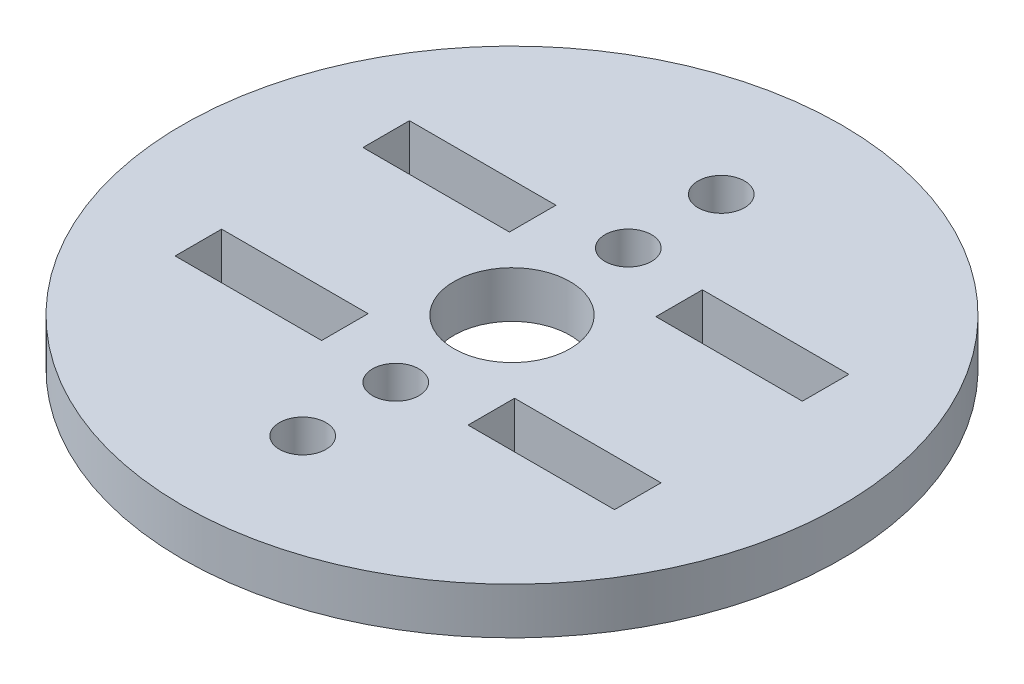
ISO-10303-21;
HEADER;
FILE_DESCRIPTION(('STEP AP214'),'2;1');
FILE_NAME('part.step','',(''),(''),'','','');
FILE_SCHEMA(('AUTOMOTIVE_DESIGN { 1 0 10303 214 1 1 1 1 }'));
ENDSEC;
DATA;
#1=APPLICATION_CONTEXT('core data for automotive mechanical design processes');
#2=APPLICATION_PROTOCOL_DEFINITION('international standard','automotive_design',2000,#1);
#3=PRODUCT_CONTEXT('',#1,'mechanical');
#4=PRODUCT('Part','Part','',(#3));
#5=PRODUCT_RELATED_PRODUCT_CATEGORY('part','',(#4));
#6=PRODUCT_DEFINITION_FORMATION('','',#4);
#7=PRODUCT_DEFINITION_CONTEXT('part definition',#1,'design');
#8=PRODUCT_DEFINITION('design','',#6,#7);
#9=PRODUCT_DEFINITION_SHAPE('','',#8);
#10=(LENGTH_UNIT() NAMED_UNIT(*) SI_UNIT(.MILLI.,.METRE.));
#11=(NAMED_UNIT(*) PLANE_ANGLE_UNIT() SI_UNIT($,.RADIAN.));
#12=(NAMED_UNIT(*) SI_UNIT($,.STERADIAN.) SOLID_ANGLE_UNIT());
#13=UNCERTAINTY_MEASURE_WITH_UNIT(LENGTH_MEASURE(1.E-05),#10,'distance_accuracy_value','');
#14=(GEOMETRIC_REPRESENTATION_CONTEXT(3) GLOBAL_UNCERTAINTY_ASSIGNED_CONTEXT((#13)) GLOBAL_UNIT_ASSIGNED_CONTEXT((#10,
#11,#12)) REPRESENTATION_CONTEXT('',''));
#15=CARTESIAN_POINT('',(0.,0.,0.));
#16=DIRECTION('',(0.,0.,1.));
#17=DIRECTION('',(1.,0.,0.));
#18=AXIS2_PLACEMENT_3D('',#15,#16,#17);
#19=CARTESIAN_POINT('',(0.,3.175,0.));
#20=DIRECTION('',(0.,1.,0.));
#21=DIRECTION('',(0.,0.,1.));
#22=AXIS2_PLACEMENT_3D('',#19,#20,#21);
#23=PLANE('',#22);
#24=CARTESIAN_POINT('',(0.,3.175,-14.2875));
#25=DIRECTION('',(0.,1.,0.));
#26=DIRECTION('',(0.,0.,1.));
#27=AXIS2_PLACEMENT_3D('',#24,#25,#26);
#28=CIRCLE('',#27,1.5875);
#29=CARTESIAN_POINT('',(0.,3.175,-12.7));
#30=VERTEX_POINT('',#29);
#31=EDGE_CURVE('E312',#30,#30,#28,.T.);
#32=ORIENTED_EDGE('',*,*,#31,.F.);
#33=EDGE_LOOP('',(#32));
#34=FACE_BOUND('',#33,.T.);
#35=CARTESIAN_POINT('',(0.,3.175,-7.9375));
#36=DIRECTION('',(0.,1.,0.));
#37=DIRECTION('',(0.,0.,1.));
#38=AXIS2_PLACEMENT_3D('',#35,#36,#37);
#39=CIRCLE('',#38,1.5875);
#40=CARTESIAN_POINT('',(0.,3.175,-6.35));
#41=VERTEX_POINT('',#40);
#42=EDGE_CURVE('E177',#41,#41,#39,.T.);
#43=ORIENTED_EDGE('',*,*,#42,.F.);
#44=EDGE_LOOP('',(#43));
#45=FACE_BOUND('',#44,.T.);
#46=DIRECTION('',(1.,0.,0.));
#47=VECTOR('',#46,1.);
#48=CARTESIAN_POINT('',(-15.,3.175,8.));
#49=LINE('',#48,#47);
#50=CARTESIAN_POINT('',(-15.,3.175,8.));
#51=VERTEX_POINT('',#50);
#52=CARTESIAN_POINT('',(-5.,3.175,8.));
#53=VERTEX_POINT('',#52);
#54=EDGE_CURVE('E189',#51,#53,#49,.T.);
#55=ORIENTED_EDGE('',*,*,#54,.F.);
#56=DIRECTION('',(0.,0.,1.));
#57=VECTOR('',#56,1.);
#58=CARTESIAN_POINT('',(-15.,3.175,4.825));
#59=LINE('',#58,#57);
#60=CARTESIAN_POINT('',(-15.,3.175,4.825));
#61=VERTEX_POINT('',#60);
#62=EDGE_CURVE('E187',#61,#51,#59,.T.);
#63=ORIENTED_EDGE('',*,*,#62,.F.);
#64=DIRECTION('',(-1.,0.,0.));
#65=VECTOR('',#64,1.);
#66=CARTESIAN_POINT('',(-15.,3.175,4.825));
#67=LINE('',#66,#65);
#68=CARTESIAN_POINT('',(-5.,3.175,4.825));
#69=VERTEX_POINT('',#68);
#70=EDGE_CURVE('E195',#69,#61,#67,.T.);
#71=ORIENTED_EDGE('',*,*,#70,.F.);
#72=DIRECTION('',(0.,0.,-1.));
#73=VECTOR('',#72,1.);
#74=CARTESIAN_POINT('',(-5.,3.175,4.825));
#75=LINE('',#74,#73);
#76=EDGE_CURVE('E192',#53,#69,#75,.T.);
#77=ORIENTED_EDGE('',*,*,#76,.F.);
#78=EDGE_LOOP('',(#55,#63,#71,#77));
#79=FACE_BOUND('',#78,.T.);
#80=DIRECTION('',(1.,0.,0.));
#81=VECTOR('',#80,1.);
#82=CARTESIAN_POINT('',(-15.,3.175,-4.825));
#83=LINE('',#82,#81);
#84=CARTESIAN_POINT('',(-15.,3.175,-4.825));
#85=VERTEX_POINT('',#84);
#86=CARTESIAN_POINT('',(-5.,3.175,-4.825));
#87=VERTEX_POINT('',#86);
#88=EDGE_CURVE('E251',#85,#87,#83,.T.);
#89=ORIENTED_EDGE('',*,*,#88,.F.);
#90=DIRECTION('',(0.,0.,1.));
#91=VECTOR('',#90,1.);
#92=CARTESIAN_POINT('',(-15.,3.175,-8.));
#93=LINE('',#92,#91);
#94=CARTESIAN_POINT('',(-15.,3.175,-8.));
#95=VERTEX_POINT('',#94);
#96=EDGE_CURVE('E249',#95,#85,#93,.T.);
#97=ORIENTED_EDGE('',*,*,#96,.F.);
#98=DIRECTION('',(-1.,0.,0.));
#99=VECTOR('',#98,1.);
#100=CARTESIAN_POINT('',(-15.,3.175,-8.));
#101=LINE('',#100,#99);
#102=CARTESIAN_POINT('',(-5.,3.175,-8.));
#103=VERTEX_POINT('',#102);
#104=EDGE_CURVE('E257',#103,#95,#101,.T.);
#105=ORIENTED_EDGE('',*,*,#104,.F.);
#106=DIRECTION('',(0.,0.,-1.));
#107=VECTOR('',#106,1.);
#108=CARTESIAN_POINT('',(-5.,3.175,-8.));
#109=LINE('',#108,#107);
#110=EDGE_CURVE('E254',#87,#103,#109,.T.);
#111=ORIENTED_EDGE('',*,*,#110,.F.);
#112=EDGE_LOOP('',(#89,#97,#105,#111));
#113=FACE_BOUND('',#112,.T.);
#114=CARTESIAN_POINT('',(0.,3.175,0.));
#115=DIRECTION('',(0.,1.,0.));
#116=DIRECTION('',(0.,0.,1.));
#117=AXIS2_PLACEMENT_3D('',#114,#115,#116);
#118=CIRCLE('',#117,22.5);
#119=CARTESIAN_POINT('',(0.,3.175,22.5));
#120=VERTEX_POINT('',#119);
#121=EDGE_CURVE('E11',#120,#120,#118,.T.);
#122=ORIENTED_EDGE('',*,*,#121,.T.);
#123=EDGE_LOOP('',(#122));
#124=FACE_BOUND('',#123,.T.);
#125=CARTESIAN_POINT('',(0.,3.175,0.));
#126=DIRECTION('',(0.,1.,0.));
#127=DIRECTION('',(0.,0.,1.));
#128=AXIS2_PLACEMENT_3D('',#125,#126,#127);
#129=CIRCLE('',#128,3.96875);
#130=CARTESIAN_POINT('',(0.,3.175,3.96875));
#131=VERTEX_POINT('',#130);
#132=EDGE_CURVE('E280',#131,#131,#129,.T.);
#133=ORIENTED_EDGE('',*,*,#132,.F.);
#134=EDGE_LOOP('',(#133));
#135=FACE_BOUND('',#134,.T.);
#136=DIRECTION('',(1.,0.,0.));
#137=VECTOR('',#136,1.);
#138=CARTESIAN_POINT('',(5.,3.175,-4.825));
#139=LINE('',#138,#137);
#140=CARTESIAN_POINT('',(5.,3.175,-4.825));
#141=VERTEX_POINT('',#140);
#142=CARTESIAN_POINT('',(15.,3.175,-4.825));
#143=VERTEX_POINT('',#142);
#144=EDGE_CURVE('E220',#141,#143,#139,.T.);
#145=ORIENTED_EDGE('',*,*,#144,.F.);
#146=DIRECTION('',(0.,0.,1.));
#147=VECTOR('',#146,1.);
#148=CARTESIAN_POINT('',(5.,3.175,-8.));
#149=LINE('',#148,#147);
#150=CARTESIAN_POINT('',(5.,3.175,-8.));
#151=VERTEX_POINT('',#150);
#152=EDGE_CURVE('E218',#151,#141,#149,.T.);
#153=ORIENTED_EDGE('',*,*,#152,.F.);
#154=DIRECTION('',(-1.,0.,0.));
#155=VECTOR('',#154,1.);
#156=CARTESIAN_POINT('',(5.,3.175,-8.));
#157=LINE('',#156,#155);
#158=CARTESIAN_POINT('',(15.,3.175,-8.));
#159=VERTEX_POINT('',#158);
#160=EDGE_CURVE('E226',#159,#151,#157,.T.);
#161=ORIENTED_EDGE('',*,*,#160,.F.);
#162=DIRECTION('',(0.,0.,-1.));
#163=VECTOR('',#162,1.);
#164=CARTESIAN_POINT('',(15.,3.175,-8.));
#165=LINE('',#164,#163);
#166=EDGE_CURVE('E223',#143,#159,#165,.T.);
#167=ORIENTED_EDGE('',*,*,#166,.F.);
#168=EDGE_LOOP('',(#145,#153,#161,#167));
#169=FACE_BOUND('',#168,.T.);
#170=DIRECTION('',(1.,0.,0.));
#171=VECTOR('',#170,1.);
#172=CARTESIAN_POINT('',(5.,3.175,8.));
#173=LINE('',#172,#171);
#174=CARTESIAN_POINT('',(5.,3.175,8.));
#175=VERTEX_POINT('',#174);
#176=CARTESIAN_POINT('',(15.,3.175,8.));
#177=VERTEX_POINT('',#176);
#178=EDGE_CURVE('E156',#175,#177,#173,.T.);
#179=ORIENTED_EDGE('',*,*,#178,.F.);
#180=DIRECTION('',(0.,0.,1.));
#181=VECTOR('',#180,1.);
#182=CARTESIAN_POINT('',(5.,3.175,4.825));
#183=LINE('',#182,#181);
#184=CARTESIAN_POINT('',(5.,3.175,4.825));
#185=VERTEX_POINT('',#184);
#186=EDGE_CURVE('E148',#185,#175,#183,.T.);
#187=ORIENTED_EDGE('',*,*,#186,.F.);
#188=DIRECTION('',(-1.,0.,0.));
#189=VECTOR('',#188,1.);
#190=CARTESIAN_POINT('',(5.,3.175,4.825));
#191=LINE('',#190,#189);
#192=CARTESIAN_POINT('',(15.,3.175,4.825));
#193=VERTEX_POINT('',#192);
#194=EDGE_CURVE('E171',#193,#185,#191,.T.);
#195=ORIENTED_EDGE('',*,*,#194,.F.);
#196=DIRECTION('',(0.,0.,-1.));
#197=VECTOR('',#196,1.);
#198=CARTESIAN_POINT('',(15.,3.175,4.825));
#199=LINE('',#198,#197);
#200=EDGE_CURVE('E169',#177,#193,#199,.T.);
#201=ORIENTED_EDGE('',*,*,#200,.F.);
#202=EDGE_LOOP('',(#179,#187,#195,#201));
#203=FACE_BOUND('',#202,.T.);
#204=CARTESIAN_POINT('',(0.,3.175,7.9375));
#205=DIRECTION('',(0.,1.,0.));
#206=DIRECTION('',(0.,0.,1.));
#207=AXIS2_PLACEMENT_3D('',#204,#205,#206);
#208=CIRCLE('',#207,1.5875);
#209=CARTESIAN_POINT('',(0.,3.175,9.525));
#210=VERTEX_POINT('',#209);
#211=EDGE_CURVE('E541',#210,#210,#208,.T.);
#212=ORIENTED_EDGE('',*,*,#211,.F.);
#213=EDGE_LOOP('',(#212));
#214=FACE_BOUND('',#213,.T.);
#215=CARTESIAN_POINT('',(0.,3.175,14.2875));
#216=DIRECTION('',(0.,1.,0.));
#217=DIRECTION('',(0.,0.,1.));
#218=AXIS2_PLACEMENT_3D('',#215,#216,#217);
#219=CIRCLE('',#218,1.5875);
#220=CARTESIAN_POINT('',(0.,3.175,15.875));
#221=VERTEX_POINT('',#220);
#222=EDGE_CURVE('E528',#221,#221,#219,.T.);
#223=ORIENTED_EDGE('',*,*,#222,.F.);
#224=EDGE_LOOP('',(#223));
#225=FACE_BOUND('',#224,.T.);
#226=ADVANCED_FACE('F35',(#34,#45,#79,#113,#124,#135,#169,#203,#214,#225),#23,.T.);
#227=CARTESIAN_POINT('',(0.,0.,0.));
#228=DIRECTION('',(0.,1.,0.));
#229=DIRECTION('',(0.,0.,1.));
#230=AXIS2_PLACEMENT_3D('',#227,#228,#229);
#231=PLANE('',#230);
#232=CARTESIAN_POINT('',(0.,0.,-14.2875));
#233=DIRECTION('',(0.,1.,0.));
#234=DIRECTION('',(0.,0.,1.));
#235=AXIS2_PLACEMENT_3D('',#232,#233,#234);
#236=CIRCLE('',#235,1.5875);
#237=CARTESIAN_POINT('',(0.,0.,-12.7));
#238=VERTEX_POINT('',#237);
#239=EDGE_CURVE('E534',#238,#238,#236,.T.);
#240=ORIENTED_EDGE('',*,*,#239,.T.);
#241=EDGE_LOOP('',(#240));
#242=FACE_BOUND('',#241,.T.);
#243=CARTESIAN_POINT('',(0.,0.,-7.9375));
#244=DIRECTION('',(0.,1.,0.));
#245=DIRECTION('',(0.,0.,1.));
#246=AXIS2_PLACEMENT_3D('',#243,#244,#245);
#247=CIRCLE('',#246,1.5875);
#248=CARTESIAN_POINT('',(0.,0.,-6.35));
#249=VERTEX_POINT('',#248);
#250=EDGE_CURVE('E544',#249,#249,#247,.T.);
#251=ORIENTED_EDGE('',*,*,#250,.T.);
#252=EDGE_LOOP('',(#251));
#253=FACE_BOUND('',#252,.T.);
#254=DIRECTION('',(0.,0.,1.));
#255=VECTOR('',#254,1.);
#256=CARTESIAN_POINT('',(-15.,0.,4.825));
#257=LINE('',#256,#255);
#258=CARTESIAN_POINT('',(-15.,0.,4.825));
#259=VERTEX_POINT('',#258);
#260=CARTESIAN_POINT('',(-15.,0.,8.));
#261=VERTEX_POINT('',#260);
#262=EDGE_CURVE('E164',#259,#261,#257,.T.);
#263=ORIENTED_EDGE('',*,*,#262,.T.);
#264=DIRECTION('',(1.,0.,0.));
#265=VECTOR('',#264,1.);
#266=CARTESIAN_POINT('',(-15.,0.,8.));
#267=LINE('',#266,#265);
#268=CARTESIAN_POINT('',(-5.,0.,8.));
#269=VERTEX_POINT('',#268);
#270=EDGE_CURVE('E200',#261,#269,#267,.T.);
#271=ORIENTED_EDGE('',*,*,#270,.T.);
#272=DIRECTION('',(0.,0.,-1.));
#273=VECTOR('',#272,1.);
#274=CARTESIAN_POINT('',(-5.,0.,4.825));
#275=LINE('',#274,#273);
#276=CARTESIAN_POINT('',(-5.,0.,4.825));
#277=VERTEX_POINT('',#276);
#278=EDGE_CURVE('E203',#269,#277,#275,.T.);
#279=ORIENTED_EDGE('',*,*,#278,.T.);
#280=DIRECTION('',(-1.,0.,0.));
#281=VECTOR('',#280,1.);
#282=CARTESIAN_POINT('',(-15.,0.,4.825));
#283=LINE('',#282,#281);
#284=EDGE_CURVE('E190',#277,#259,#283,.T.);
#285=ORIENTED_EDGE('',*,*,#284,.T.);
#286=EDGE_LOOP('',(#263,#271,#279,#285));
#287=FACE_BOUND('',#286,.T.);
#288=DIRECTION('',(0.,0.,1.));
#289=VECTOR('',#288,1.);
#290=CARTESIAN_POINT('',(-15.,0.,-8.));
#291=LINE('',#290,#289);
#292=CARTESIAN_POINT('',(-15.,0.,-8.));
#293=VERTEX_POINT('',#292);
#294=CARTESIAN_POINT('',(-15.,0.,-4.825));
#295=VERTEX_POINT('',#294);
#296=EDGE_CURVE('E248',#293,#295,#291,.T.);
#297=ORIENTED_EDGE('',*,*,#296,.T.);
#298=DIRECTION('',(1.,0.,0.));
#299=VECTOR('',#298,1.);
#300=CARTESIAN_POINT('',(-15.,0.,-4.825));
#301=LINE('',#300,#299);
#302=CARTESIAN_POINT('',(-5.,0.,-4.825));
#303=VERTEX_POINT('',#302);
#304=EDGE_CURVE('E262',#295,#303,#301,.T.);
#305=ORIENTED_EDGE('',*,*,#304,.T.);
#306=DIRECTION('',(0.,0.,-1.));
#307=VECTOR('',#306,1.);
#308=CARTESIAN_POINT('',(-5.,0.,-8.));
#309=LINE('',#308,#307);
#310=CARTESIAN_POINT('',(-5.,0.,-8.));
#311=VERTEX_POINT('',#310);
#312=EDGE_CURVE('E265',#303,#311,#309,.T.);
#313=ORIENTED_EDGE('',*,*,#312,.T.);
#314=DIRECTION('',(-1.,0.,0.));
#315=VECTOR('',#314,1.);
#316=CARTESIAN_POINT('',(-15.,0.,-8.));
#317=LINE('',#316,#315);
#318=EDGE_CURVE('E252',#311,#293,#317,.T.);
#319=ORIENTED_EDGE('',*,*,#318,.T.);
#320=EDGE_LOOP('',(#297,#305,#313,#319));
#321=FACE_BOUND('',#320,.T.);
#322=CARTESIAN_POINT('',(0.,0.,0.));
#323=DIRECTION('',(0.,1.,0.));
#324=DIRECTION('',(0.,0.,1.));
#325=AXIS2_PLACEMENT_3D('',#322,#323,#324);
#326=CIRCLE('',#325,22.5);
#327=CARTESIAN_POINT('',(0.,0.,22.5));
#328=VERTEX_POINT('',#327);
#329=EDGE_CURVE('E39',#328,#328,#326,.T.);
#330=ORIENTED_EDGE('',*,*,#329,.F.);
#331=EDGE_LOOP('',(#330));
#332=FACE_BOUND('',#331,.T.);
#333=CARTESIAN_POINT('',(0.,0.,0.));
#334=DIRECTION('',(0.,1.,0.));
#335=DIRECTION('',(0.,0.,1.));
#336=AXIS2_PLACEMENT_3D('',#333,#334,#335);
#337=CIRCLE('',#336,3.96875);
#338=CARTESIAN_POINT('',(0.,0.,3.96875));
#339=VERTEX_POINT('',#338);
#340=EDGE_CURVE('E279',#339,#339,#337,.T.);
#341=ORIENTED_EDGE('',*,*,#340,.T.);
#342=EDGE_LOOP('',(#341));
#343=FACE_BOUND('',#342,.T.);
#344=DIRECTION('',(0.,0.,1.));
#345=VECTOR('',#344,1.);
#346=CARTESIAN_POINT('',(5.,0.,-8.));
#347=LINE('',#346,#345);
#348=CARTESIAN_POINT('',(5.,0.,-8.));
#349=VERTEX_POINT('',#348);
#350=CARTESIAN_POINT('',(5.,0.,-4.825));
#351=VERTEX_POINT('',#350);
#352=EDGE_CURVE('E217',#349,#351,#347,.T.);
#353=ORIENTED_EDGE('',*,*,#352,.T.);
#354=DIRECTION('',(1.,0.,0.));
#355=VECTOR('',#354,1.);
#356=CARTESIAN_POINT('',(5.,0.,-4.825));
#357=LINE('',#356,#355);
#358=CARTESIAN_POINT('',(15.,0.,-4.825));
#359=VERTEX_POINT('',#358);
#360=EDGE_CURVE('E231',#351,#359,#357,.T.);
#361=ORIENTED_EDGE('',*,*,#360,.T.);
#362=DIRECTION('',(0.,0.,-1.));
#363=VECTOR('',#362,1.);
#364=CARTESIAN_POINT('',(15.,0.,-8.));
#365=LINE('',#364,#363);
#366=CARTESIAN_POINT('',(15.,0.,-8.));
#367=VERTEX_POINT('',#366);
#368=EDGE_CURVE('E234',#359,#367,#365,.T.);
#369=ORIENTED_EDGE('',*,*,#368,.T.);
#370=DIRECTION('',(-1.,0.,0.));
#371=VECTOR('',#370,1.);
#372=CARTESIAN_POINT('',(5.,0.,-8.));
#373=LINE('',#372,#371);
#374=EDGE_CURVE('E221',#367,#349,#373,.T.);
#375=ORIENTED_EDGE('',*,*,#374,.T.);
#376=EDGE_LOOP('',(#353,#361,#369,#375));
#377=FACE_BOUND('',#376,.T.);
#378=DIRECTION('',(0.,0.,1.));
#379=VECTOR('',#378,1.);
#380=CARTESIAN_POINT('',(5.,0.,4.825));
#381=LINE('',#380,#379);
#382=CARTESIAN_POINT('',(5.,0.,4.825));
#383=VERTEX_POINT('',#382);
#384=CARTESIAN_POINT('',(5.,0.,8.));
#385=VERTEX_POINT('',#384);
#386=EDGE_CURVE('E58',#383,#385,#381,.T.);
#387=ORIENTED_EDGE('',*,*,#386,.T.);
#388=DIRECTION('',(1.,0.,0.));
#389=VECTOR('',#388,1.);
#390=CARTESIAN_POINT('',(5.,0.,8.));
#391=LINE('',#390,#389);
#392=CARTESIAN_POINT('',(15.,0.,8.));
#393=VERTEX_POINT('',#392);
#394=EDGE_CURVE('E163',#385,#393,#391,.T.);
#395=ORIENTED_EDGE('',*,*,#394,.T.);
#396=DIRECTION('',(0.,0.,-1.));
#397=VECTOR('',#396,1.);
#398=CARTESIAN_POINT('',(15.,0.,4.825));
#399=LINE('',#398,#397);
#400=CARTESIAN_POINT('',(15.,0.,4.825));
#401=VERTEX_POINT('',#400);
#402=EDGE_CURVE('E179',#393,#401,#399,.T.);
#403=ORIENTED_EDGE('',*,*,#402,.T.);
#404=DIRECTION('',(-1.,0.,0.));
#405=VECTOR('',#404,1.);
#406=CARTESIAN_POINT('',(5.,0.,4.825));
#407=LINE('',#406,#405);
#408=EDGE_CURVE('E157',#401,#383,#407,.T.);
#409=ORIENTED_EDGE('',*,*,#408,.T.);
#410=EDGE_LOOP('',(#387,#395,#403,#409));
#411=FACE_BOUND('',#410,.T.);
#412=CARTESIAN_POINT('',(0.,0.,7.9375));
#413=DIRECTION('',(0.,1.,0.));
#414=DIRECTION('',(0.,0.,1.));
#415=AXIS2_PLACEMENT_3D('',#412,#413,#414);
#416=CIRCLE('',#415,1.5875);
#417=CARTESIAN_POINT('',(0.,0.,9.525));
#418=VERTEX_POINT('',#417);
#419=EDGE_CURVE('E538',#418,#418,#416,.T.);
#420=ORIENTED_EDGE('',*,*,#419,.T.);
#421=EDGE_LOOP('',(#420));
#422=FACE_BOUND('',#421,.T.);
#423=CARTESIAN_POINT('',(0.,0.,14.2875));
#424=DIRECTION('',(0.,1.,0.));
#425=DIRECTION('',(0.,0.,1.));
#426=AXIS2_PLACEMENT_3D('',#423,#424,#425);
#427=CIRCLE('',#426,1.5875);
#428=CARTESIAN_POINT('',(0.,0.,15.875));
#429=VERTEX_POINT('',#428);
#430=EDGE_CURVE('E531',#429,#429,#427,.T.);
#431=ORIENTED_EDGE('',*,*,#430,.T.);
#432=EDGE_LOOP('',(#431));
#433=FACE_BOUND('',#432,.T.);
#434=ADVANCED_FACE('F286',(#242,#253,#287,#321,#332,#343,#377,#411,#422,#433),#231,.F.);
#435=CARTESIAN_POINT('',(0.,3.175,0.));
#436=DIRECTION('',(0.,-1.,0.));
#437=DIRECTION('',(0.,0.,-1.));
#438=AXIS2_PLACEMENT_3D('',#435,#436,#437);
#439=CYLINDRICAL_SURFACE('',#438,22.5);
#440=ORIENTED_EDGE('',*,*,#121,.F.);
#441=EDGE_LOOP('',(#440));
#442=FACE_BOUND('',#441,.T.);
#443=ORIENTED_EDGE('',*,*,#329,.T.);
#444=EDGE_LOOP('',(#443));
#445=FACE_BOUND('',#444,.T.);
#446=ADVANCED_FACE('F37',(#442,#445),#439,.T.);
#447=CARTESIAN_POINT('',(0.,3.175,0.));
#448=DIRECTION('',(0.,-1.,0.));
#449=DIRECTION('',(0.,0.,-1.));
#450=AXIS2_PLACEMENT_3D('',#447,#448,#449);
#451=CYLINDRICAL_SURFACE('',#450,3.96875);
#452=ORIENTED_EDGE('',*,*,#132,.T.);
#453=EDGE_LOOP('',(#452));
#454=FACE_BOUND('',#453,.T.);
#455=ORIENTED_EDGE('',*,*,#340,.F.);
#456=EDGE_LOOP('',(#455));
#457=FACE_BOUND('',#456,.T.);
#458=ADVANCED_FACE('F289',(#454,#457),#451,.F.);
#459=CARTESIAN_POINT('',(-15.,3.175,-8.));
#460=DIRECTION('',(1.,0.,0.));
#461=DIRECTION('',(0.,0.,-1.));
#462=AXIS2_PLACEMENT_3D('',#459,#460,#461);
#463=PLANE('',#462);
#464=ORIENTED_EDGE('',*,*,#296,.F.);
#465=DIRECTION('',(0.,-1.,0.));
#466=VECTOR('',#465,1.);
#467=CARTESIAN_POINT('',(-15.,3.175,-8.));
#468=LINE('',#467,#466);
#469=EDGE_CURVE('E259',#95,#293,#468,.T.);
#470=ORIENTED_EDGE('',*,*,#469,.F.);
#471=ORIENTED_EDGE('',*,*,#96,.T.);
#472=DIRECTION('',(0.,-1.,0.));
#473=VECTOR('',#472,1.);
#474=CARTESIAN_POINT('',(-15.,3.175,-4.825));
#475=LINE('',#474,#473);
#476=EDGE_CURVE('E276',#85,#295,#475,.T.);
#477=ORIENTED_EDGE('',*,*,#476,.T.);
#478=EDGE_LOOP('',(#464,#470,#471,#477));
#479=FACE_BOUND('',#478,.T.);
#480=ADVANCED_FACE('F291',(#479),#463,.T.);
#481=CARTESIAN_POINT('',(-15.,3.175,-4.825));
#482=DIRECTION('',(0.,0.,-1.));
#483=DIRECTION('',(-1.,0.,0.));
#484=AXIS2_PLACEMENT_3D('',#481,#482,#483);
#485=PLANE('',#484);
#486=ORIENTED_EDGE('',*,*,#304,.F.);
#487=ORIENTED_EDGE('',*,*,#476,.F.);
#488=ORIENTED_EDGE('',*,*,#88,.T.);
#489=DIRECTION('',(0.,-1.,0.));
#490=VECTOR('',#489,1.);
#491=CARTESIAN_POINT('',(-5.,3.175,-4.825));
#492=LINE('',#491,#490);
#493=EDGE_CURVE('E274',#87,#303,#492,.T.);
#494=ORIENTED_EDGE('',*,*,#493,.T.);
#495=EDGE_LOOP('',(#486,#487,#488,#494));
#496=FACE_BOUND('',#495,.T.);
#497=ADVANCED_FACE('F298',(#496),#485,.T.);
#498=CARTESIAN_POINT('',(-5.,3.175,-8.));
#499=DIRECTION('',(-1.,0.,0.));
#500=DIRECTION('',(0.,0.,1.));
#501=AXIS2_PLACEMENT_3D('',#498,#499,#500);
#502=PLANE('',#501);
#503=ORIENTED_EDGE('',*,*,#312,.F.);
#504=ORIENTED_EDGE('',*,*,#493,.F.);
#505=ORIENTED_EDGE('',*,*,#110,.T.);
#506=DIRECTION('',(0.,-1.,0.));
#507=VECTOR('',#506,1.);
#508=CARTESIAN_POINT('',(-5.,3.175,-8.));
#509=LINE('',#508,#507);
#510=EDGE_CURVE('E272',#103,#311,#509,.T.);
#511=ORIENTED_EDGE('',*,*,#510,.T.);
#512=EDGE_LOOP('',(#503,#504,#505,#511));
#513=FACE_BOUND('',#512,.T.);
#514=ADVANCED_FACE('F366',(#513),#502,.T.);
#515=CARTESIAN_POINT('',(-15.,3.175,-8.));
#516=DIRECTION('',(0.,0.,1.));
#517=DIRECTION('',(1.,0.,0.));
#518=AXIS2_PLACEMENT_3D('',#515,#516,#517);
#519=PLANE('',#518);
#520=ORIENTED_EDGE('',*,*,#318,.F.);
#521=ORIENTED_EDGE('',*,*,#510,.F.);
#522=ORIENTED_EDGE('',*,*,#104,.T.);
#523=ORIENTED_EDGE('',*,*,#469,.T.);
#524=EDGE_LOOP('',(#520,#521,#522,#523));
#525=FACE_BOUND('',#524,.T.);
#526=ADVANCED_FACE('F363',(#525),#519,.T.);
#527=CARTESIAN_POINT('',(5.,3.175,-8.));
#528=DIRECTION('',(1.,0.,0.));
#529=DIRECTION('',(0.,0.,-1.));
#530=AXIS2_PLACEMENT_3D('',#527,#528,#529);
#531=PLANE('',#530);
#532=ORIENTED_EDGE('',*,*,#352,.F.);
#533=DIRECTION('',(0.,-1.,0.));
#534=VECTOR('',#533,1.);
#535=CARTESIAN_POINT('',(5.,3.175,-8.));
#536=LINE('',#535,#534);
#537=EDGE_CURVE('E228',#151,#349,#536,.T.);
#538=ORIENTED_EDGE('',*,*,#537,.F.);
#539=ORIENTED_EDGE('',*,*,#152,.T.);
#540=DIRECTION('',(0.,-1.,0.));
#541=VECTOR('',#540,1.);
#542=CARTESIAN_POINT('',(5.,3.175,-4.825));
#543=LINE('',#542,#541);
#544=EDGE_CURVE('E245',#141,#351,#543,.T.);
#545=ORIENTED_EDGE('',*,*,#544,.T.);
#546=EDGE_LOOP('',(#532,#538,#539,#545));
#547=FACE_BOUND('',#546,.T.);
#548=ADVANCED_FACE('F342',(#547),#531,.T.);
#549=CARTESIAN_POINT('',(5.,3.175,-4.825));
#550=DIRECTION('',(0.,0.,-1.));
#551=DIRECTION('',(-1.,0.,0.));
#552=AXIS2_PLACEMENT_3D('',#549,#550,#551);
#553=PLANE('',#552);
#554=ORIENTED_EDGE('',*,*,#360,.F.);
#555=ORIENTED_EDGE('',*,*,#544,.F.);
#556=ORIENTED_EDGE('',*,*,#144,.T.);
#557=DIRECTION('',(0.,-1.,0.));
#558=VECTOR('',#557,1.);
#559=CARTESIAN_POINT('',(15.,3.175,-4.825));
#560=LINE('',#559,#558);
#561=EDGE_CURVE('E243',#143,#359,#560,.T.);
#562=ORIENTED_EDGE('',*,*,#561,.T.);
#563=EDGE_LOOP('',(#554,#555,#556,#562));
#564=FACE_BOUND('',#563,.T.);
#565=ADVANCED_FACE('F335',(#564),#553,.T.);
#566=CARTESIAN_POINT('',(15.,3.175,-8.));
#567=DIRECTION('',(-1.,0.,0.));
#568=DIRECTION('',(0.,0.,1.));
#569=AXIS2_PLACEMENT_3D('',#566,#567,#568);
#570=PLANE('',#569);
#571=ORIENTED_EDGE('',*,*,#368,.F.);
#572=ORIENTED_EDGE('',*,*,#561,.F.);
#573=ORIENTED_EDGE('',*,*,#166,.T.);
#574=DIRECTION('',(0.,-1.,0.));
#575=VECTOR('',#574,1.);
#576=CARTESIAN_POINT('',(15.,3.175,-8.));
#577=LINE('',#576,#575);
#578=EDGE_CURVE('E241',#159,#367,#577,.T.);
#579=ORIENTED_EDGE('',*,*,#578,.T.);
#580=EDGE_LOOP('',(#571,#572,#573,#579));
#581=FACE_BOUND('',#580,.T.);
#582=ADVANCED_FACE('F338',(#581),#570,.T.);
#583=CARTESIAN_POINT('',(5.,3.175,-8.));
#584=DIRECTION('',(0.,0.,1.));
#585=DIRECTION('',(1.,0.,0.));
#586=AXIS2_PLACEMENT_3D('',#583,#584,#585);
#587=PLANE('',#586);
#588=ORIENTED_EDGE('',*,*,#374,.F.);
#589=ORIENTED_EDGE('',*,*,#578,.F.);
#590=ORIENTED_EDGE('',*,*,#160,.T.);
#591=ORIENTED_EDGE('',*,*,#537,.T.);
#592=EDGE_LOOP('',(#588,#589,#590,#591));
#593=FACE_BOUND('',#592,.T.);
#594=ADVANCED_FACE('F345',(#593),#587,.T.);
#595=CARTESIAN_POINT('',(-15.,3.175,4.825));
#596=DIRECTION('',(1.,0.,0.));
#597=DIRECTION('',(0.,0.,-1.));
#598=AXIS2_PLACEMENT_3D('',#595,#596,#597);
#599=PLANE('',#598);
#600=ORIENTED_EDGE('',*,*,#262,.F.);
#601=DIRECTION('',(0.,-1.,0.));
#602=VECTOR('',#601,1.);
#603=CARTESIAN_POINT('',(-15.,3.175,4.825));
#604=LINE('',#603,#602);
#605=EDGE_CURVE('E197',#61,#259,#604,.T.);
#606=ORIENTED_EDGE('',*,*,#605,.F.);
#607=ORIENTED_EDGE('',*,*,#62,.T.);
#608=DIRECTION('',(0.,-1.,0.));
#609=VECTOR('',#608,1.);
#610=CARTESIAN_POINT('',(-15.,3.175,8.));
#611=LINE('',#610,#609);
#612=EDGE_CURVE('E214',#51,#261,#611,.T.);
#613=ORIENTED_EDGE('',*,*,#612,.T.);
#614=EDGE_LOOP('',(#600,#606,#607,#613));
#615=FACE_BOUND('',#614,.T.);
#616=ADVANCED_FACE('F347',(#615),#599,.T.);
#617=CARTESIAN_POINT('',(-15.,3.175,8.));
#618=DIRECTION('',(0.,0.,-1.));
#619=DIRECTION('',(-1.,0.,0.));
#620=AXIS2_PLACEMENT_3D('',#617,#618,#619);
#621=PLANE('',#620);
#622=ORIENTED_EDGE('',*,*,#270,.F.);
#623=ORIENTED_EDGE('',*,*,#612,.F.);
#624=ORIENTED_EDGE('',*,*,#54,.T.);
#625=DIRECTION('',(0.,-1.,0.));
#626=VECTOR('',#625,1.);
#627=CARTESIAN_POINT('',(-5.,3.175,8.));
#628=LINE('',#627,#626);
#629=EDGE_CURVE('E212',#53,#269,#628,.T.);
#630=ORIENTED_EDGE('',*,*,#629,.T.);
#631=EDGE_LOOP('',(#622,#623,#624,#630));
#632=FACE_BOUND('',#631,.T.);
#633=ADVANCED_FACE('F353',(#632),#621,.T.);
#634=CARTESIAN_POINT('',(-5.,3.175,4.825));
#635=DIRECTION('',(-1.,0.,0.));
#636=DIRECTION('',(0.,0.,1.));
#637=AXIS2_PLACEMENT_3D('',#634,#635,#636);
#638=PLANE('',#637);
#639=ORIENTED_EDGE('',*,*,#278,.F.);
#640=ORIENTED_EDGE('',*,*,#629,.F.);
#641=ORIENTED_EDGE('',*,*,#76,.T.);
#642=DIRECTION('',(0.,-1.,0.));
#643=VECTOR('',#642,1.);
#644=CARTESIAN_POINT('',(-5.,3.175,4.825));
#645=LINE('',#644,#643);
#646=EDGE_CURVE('E210',#69,#277,#645,.T.);
#647=ORIENTED_EDGE('',*,*,#646,.T.);
#648=EDGE_LOOP('',(#639,#640,#641,#647));
#649=FACE_BOUND('',#648,.T.);
#650=ADVANCED_FACE('F427',(#649),#638,.T.);
#651=CARTESIAN_POINT('',(-15.,3.175,4.825));
#652=DIRECTION('',(0.,0.,1.));
#653=DIRECTION('',(1.,0.,0.));
#654=AXIS2_PLACEMENT_3D('',#651,#652,#653);
#655=PLANE('',#654);
#656=ORIENTED_EDGE('',*,*,#284,.F.);
#657=ORIENTED_EDGE('',*,*,#646,.F.);
#658=ORIENTED_EDGE('',*,*,#70,.T.);
#659=ORIENTED_EDGE('',*,*,#605,.T.);
#660=EDGE_LOOP('',(#656,#657,#658,#659));
#661=FACE_BOUND('',#660,.T.);
#662=ADVANCED_FACE('F436',(#661),#655,.T.);
#663=CARTESIAN_POINT('',(5.,3.175,4.825));
#664=DIRECTION('',(1.,0.,0.));
#665=DIRECTION('',(0.,0.,-1.));
#666=AXIS2_PLACEMENT_3D('',#663,#664,#665);
#667=PLANE('',#666);
#668=ORIENTED_EDGE('',*,*,#386,.F.);
#669=DIRECTION('',(0.,-1.,0.));
#670=VECTOR('',#669,1.);
#671=CARTESIAN_POINT('',(5.,3.175,4.825));
#672=LINE('',#671,#670);
#673=EDGE_CURVE('E152',#185,#383,#672,.T.);
#674=ORIENTED_EDGE('',*,*,#673,.F.);
#675=ORIENTED_EDGE('',*,*,#186,.T.);
#676=DIRECTION('',(0.,-1.,0.));
#677=VECTOR('',#676,1.);
#678=CARTESIAN_POINT('',(5.,3.175,8.));
#679=LINE('',#678,#677);
#680=EDGE_CURVE('E151',#175,#385,#679,.T.);
#681=ORIENTED_EDGE('',*,*,#680,.T.);
#682=EDGE_LOOP('',(#668,#674,#675,#681));
#683=FACE_BOUND('',#682,.T.);
#684=ADVANCED_FACE('F150',(#683),#667,.T.);
#685=CARTESIAN_POINT('',(5.,3.175,8.));
#686=DIRECTION('',(0.,0.,-1.));
#687=DIRECTION('',(-1.,0.,0.));
#688=AXIS2_PLACEMENT_3D('',#685,#686,#687);
#689=PLANE('',#688);
#690=ORIENTED_EDGE('',*,*,#394,.F.);
#691=ORIENTED_EDGE('',*,*,#680,.F.);
#692=ORIENTED_EDGE('',*,*,#178,.T.);
#693=DIRECTION('',(0.,-1.,0.));
#694=VECTOR('',#693,1.);
#695=CARTESIAN_POINT('',(15.,3.175,8.));
#696=LINE('',#695,#694);
#697=EDGE_CURVE('E165',#177,#393,#696,.T.);
#698=ORIENTED_EDGE('',*,*,#697,.T.);
#699=EDGE_LOOP('',(#690,#691,#692,#698));
#700=FACE_BOUND('',#699,.T.);
#701=ADVANCED_FACE('F160',(#700),#689,.T.);
#702=CARTESIAN_POINT('',(15.,3.175,4.825));
#703=DIRECTION('',(-1.,0.,0.));
#704=DIRECTION('',(0.,0.,1.));
#705=AXIS2_PLACEMENT_3D('',#702,#703,#704);
#706=PLANE('',#705);
#707=ORIENTED_EDGE('',*,*,#402,.F.);
#708=ORIENTED_EDGE('',*,*,#697,.F.);
#709=ORIENTED_EDGE('',*,*,#200,.T.);
#710=DIRECTION('',(0.,-1.,0.));
#711=VECTOR('',#710,1.);
#712=CARTESIAN_POINT('',(15.,3.175,4.825));
#713=LINE('',#712,#711);
#714=EDGE_CURVE('E50',#193,#401,#713,.T.);
#715=ORIENTED_EDGE('',*,*,#714,.T.);
#716=EDGE_LOOP('',(#707,#708,#709,#715));
#717=FACE_BOUND('',#716,.T.);
#718=ADVANCED_FACE('F463',(#717),#706,.T.);
#719=CARTESIAN_POINT('',(5.,3.175,4.825));
#720=DIRECTION('',(0.,0.,1.));
#721=DIRECTION('',(1.,0.,0.));
#722=AXIS2_PLACEMENT_3D('',#719,#720,#721);
#723=PLANE('',#722);
#724=ORIENTED_EDGE('',*,*,#408,.F.);
#725=ORIENTED_EDGE('',*,*,#714,.F.);
#726=ORIENTED_EDGE('',*,*,#194,.T.);
#727=ORIENTED_EDGE('',*,*,#673,.T.);
#728=EDGE_LOOP('',(#724,#725,#726,#727));
#729=FACE_BOUND('',#728,.T.);
#730=ADVANCED_FACE('F472',(#729),#723,.T.);
#731=CARTESIAN_POINT('',(0.,3.175,-7.9375));
#732=DIRECTION('',(0.,-1.,0.));
#733=DIRECTION('',(0.,0.,-1.));
#734=AXIS2_PLACEMENT_3D('',#731,#732,#733);
#735=CYLINDRICAL_SURFACE('',#734,1.5875);
#736=ORIENTED_EDGE('',*,*,#42,.T.);
#737=EDGE_LOOP('',(#736));
#738=FACE_BOUND('',#737,.T.);
#739=ORIENTED_EDGE('',*,*,#250,.F.);
#740=EDGE_LOOP('',(#739));
#741=FACE_BOUND('',#740,.T.);
#742=ADVANCED_FACE('F482',(#738,#741),#735,.F.);
#743=CARTESIAN_POINT('',(0.,3.175,7.9375));
#744=DIRECTION('',(0.,-1.,0.));
#745=DIRECTION('',(0.,0.,-1.));
#746=AXIS2_PLACEMENT_3D('',#743,#744,#745);
#747=CYLINDRICAL_SURFACE('',#746,1.5875);
#748=ORIENTED_EDGE('',*,*,#211,.T.);
#749=EDGE_LOOP('',(#748));
#750=FACE_BOUND('',#749,.T.);
#751=ORIENTED_EDGE('',*,*,#419,.F.);
#752=EDGE_LOOP('',(#751));
#753=FACE_BOUND('',#752,.T.);
#754=ADVANCED_FACE('F491',(#750,#753),#747,.F.);
#755=CARTESIAN_POINT('',(0.,3.175,-14.2875));
#756=DIRECTION('',(0.,-1.,0.));
#757=DIRECTION('',(0.,0.,-1.));
#758=AXIS2_PLACEMENT_3D('',#755,#756,#757);
#759=CYLINDRICAL_SURFACE('',#758,1.5875);
#760=ORIENTED_EDGE('',*,*,#31,.T.);
#761=EDGE_LOOP('',(#760));
#762=FACE_BOUND('',#761,.T.);
#763=ORIENTED_EDGE('',*,*,#239,.F.);
#764=EDGE_LOOP('',(#763));
#765=FACE_BOUND('',#764,.T.);
#766=ADVANCED_FACE('F501',(#762,#765),#759,.F.);
#767=CARTESIAN_POINT('',(0.,3.175,14.2875));
#768=DIRECTION('',(0.,-1.,0.));
#769=DIRECTION('',(0.,0.,-1.));
#770=AXIS2_PLACEMENT_3D('',#767,#768,#769);
#771=CYLINDRICAL_SURFACE('',#770,1.5875);
#772=ORIENTED_EDGE('',*,*,#222,.T.);
#773=EDGE_LOOP('',(#772));
#774=FACE_BOUND('',#773,.T.);
#775=ORIENTED_EDGE('',*,*,#430,.F.);
#776=EDGE_LOOP('',(#775));
#777=FACE_BOUND('',#776,.T.);
#778=ADVANCED_FACE('F511',(#774,#777),#771,.F.);
#779=CLOSED_SHELL('',(#226,#434,#446,#458,#480,#497,#514,#526,#548,#565,#582,#594,#616,#633,
#650,#662,#684,#701,#718,#730,#742,#754,#766,#778));
#780=MANIFOLD_SOLID_BREP('B2',#779);
#781=ADVANCED_BREP_SHAPE_REPRESENTATION('',(#18,#780),#14);
#782=SHAPE_DEFINITION_REPRESENTATION(#9,#781);
ENDSEC;
END-ISO-10303-21;
